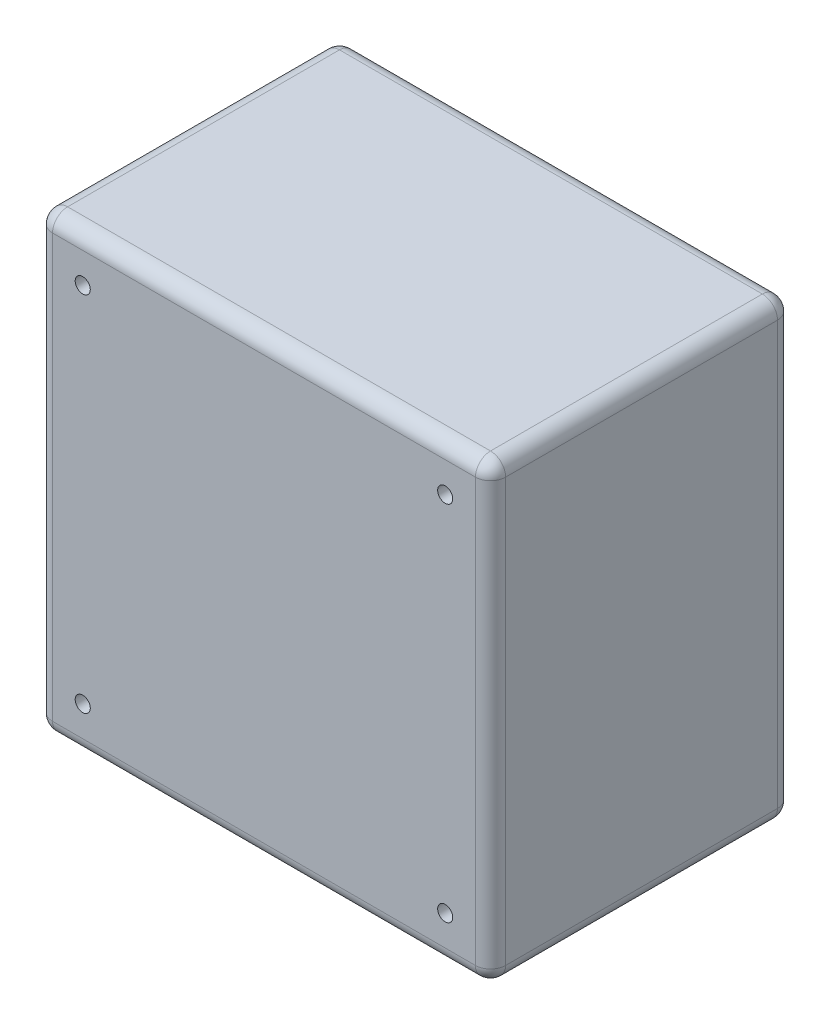
ISO-10303-21;
HEADER;
FILE_DESCRIPTION(('STEP AP214'),'2;1');
FILE_NAME('part.step','',(''),(''),'','','');
FILE_SCHEMA(('AUTOMOTIVE_DESIGN { 1 0 10303 214 1 1 1 1 }'));
ENDSEC;
DATA;
#1=APPLICATION_CONTEXT('core data for automotive mechanical design processes');
#2=APPLICATION_PROTOCOL_DEFINITION('international standard','automotive_design',2000,#1);
#3=PRODUCT_CONTEXT('',#1,'mechanical');
#4=PRODUCT('Part','Part','',(#3));
#5=PRODUCT_RELATED_PRODUCT_CATEGORY('part','',(#4));
#6=PRODUCT_DEFINITION_FORMATION('','',#4);
#7=PRODUCT_DEFINITION_CONTEXT('part definition',#1,'design');
#8=PRODUCT_DEFINITION('design','',#6,#7);
#9=PRODUCT_DEFINITION_SHAPE('','',#8);
#10=(LENGTH_UNIT() NAMED_UNIT(*) SI_UNIT(.MILLI.,.METRE.));
#11=(NAMED_UNIT(*) PLANE_ANGLE_UNIT() SI_UNIT($,.RADIAN.));
#12=(NAMED_UNIT(*) SI_UNIT($,.STERADIAN.) SOLID_ANGLE_UNIT());
#13=UNCERTAINTY_MEASURE_WITH_UNIT(LENGTH_MEASURE(1.E-05),#10,'distance_accuracy_value','');
#14=(GEOMETRIC_REPRESENTATION_CONTEXT(3) GLOBAL_UNCERTAINTY_ASSIGNED_CONTEXT((#13)) GLOBAL_UNIT_ASSIGNED_CONTEXT((#10,
#11,#12)) REPRESENTATION_CONTEXT('',''));
#15=CARTESIAN_POINT('',(0.,0.,0.));
#16=DIRECTION('',(0.,0.,1.));
#17=DIRECTION('',(1.,0.,0.));
#18=AXIS2_PLACEMENT_3D('',#15,#16,#17);
#19=CARTESIAN_POINT('',(15.,-15.,-8.));
#20=DIRECTION('',(0.,0.,1.));
#21=DIRECTION('',(1.,0.,0.));
#22=AXIS2_PLACEMENT_3D('',#19,#20,#21);
#23=CYLINDRICAL_SURFACE('',#22,2.5);
#24=CARTESIAN_POINT('',(15.,-15.,-8.));
#25=DIRECTION('',(0.,0.,1.));
#26=DIRECTION('',(1.,0.,0.));
#27=AXIS2_PLACEMENT_3D('',#24,#25,#26);
#28=CIRCLE('',#27,2.5);
#29=CARTESIAN_POINT('',(17.5,-15.,-8.));
#30=VERTEX_POINT('',#29);
#31=EDGE_CURVE('E44',#30,#30,#28,.T.);
#32=ORIENTED_EDGE('',*,*,#31,.T.);
#33=EDGE_LOOP('',(#32));
#34=FACE_BOUND('',#33,.T.);
#35=CARTESIAN_POINT('',(15.,-15.,0.));
#36=DIRECTION('',(0.,0.,1.));
#37=DIRECTION('',(1.,0.,0.));
#38=AXIS2_PLACEMENT_3D('',#35,#36,#37);
#39=CIRCLE('',#38,2.5);
#40=CARTESIAN_POINT('',(17.5,-15.,0.));
#41=VERTEX_POINT('',#40);
#42=EDGE_CURVE('E11',#41,#41,#39,.T.);
#43=ORIENTED_EDGE('',*,*,#42,.F.);
#44=EDGE_LOOP('',(#43));
#45=FACE_BOUND('',#44,.T.);
#46=ADVANCED_FACE('F40',(#34,#45),#23,.T.);
#47=CARTESIAN_POINT('',(15.,-15.,-8.));
#48=DIRECTION('',(0.,0.,1.));
#49=DIRECTION('',(1.,0.,0.));
#50=AXIS2_PLACEMENT_3D('',#47,#48,#49);
#51=PLANE('',#50);
#52=ORIENTED_EDGE('',*,*,#31,.F.);
#53=EDGE_LOOP('',(#52));
#54=FACE_BOUND('',#53,.T.);
#55=ADVANCED_FACE('F42',(#54),#51,.F.);
#56=CARTESIAN_POINT('',(15.,-15.,0.));
#57=DIRECTION('',(0.,0.,1.));
#58=DIRECTION('',(1.,0.,0.));
#59=AXIS2_PLACEMENT_3D('',#56,#57,#58);
#60=PLANE('',#59);
#61=ORIENTED_EDGE('',*,*,#42,.T.);
#62=EDGE_LOOP('',(#61));
#63=FACE_BOUND('',#62,.T.);
#64=ADVANCED_FACE('F56',(#63),#60,.T.);
#65=CLOSED_SHELL('',(#46,#55,#64));
#66=MANIFOLD_SOLID_BREP('B2',#65);
#67=CARTESIAN_POINT('',(135.,-15.,-8.));
#68=DIRECTION('',(0.,0.,1.));
#69=DIRECTION('',(1.,0.,0.));
#70=AXIS2_PLACEMENT_3D('',#67,#68,#69);
#71=CYLINDRICAL_SURFACE('',#70,2.50000000000002);
#72=CARTESIAN_POINT('',(135.,-15.,-8.));
#73=DIRECTION('',(0.,0.,-1.));
#74=DIRECTION('',(-1.,0.,0.));
#75=AXIS2_PLACEMENT_3D('',#72,#73,#74);
#76=CIRCLE('',#75,2.50000000000002);
#77=CARTESIAN_POINT('',(132.5,-15.,-8.));
#78=VERTEX_POINT('',#77);
#79=EDGE_CURVE('E93',#78,#78,#76,.T.);
#80=ORIENTED_EDGE('',*,*,#79,.F.);
#81=EDGE_LOOP('',(#80));
#82=FACE_BOUND('',#81,.T.);
#83=CARTESIAN_POINT('',(135.,-15.,0.));
#84=DIRECTION('',(0.,0.,-1.));
#85=DIRECTION('',(-1.,0.,0.));
#86=AXIS2_PLACEMENT_3D('',#83,#84,#85);
#87=CIRCLE('',#86,2.50000000000002);
#88=CARTESIAN_POINT('',(132.5,-15.,0.));
#89=VERTEX_POINT('',#88);
#90=EDGE_CURVE('E39',#89,#89,#87,.T.);
#91=ORIENTED_EDGE('',*,*,#90,.T.);
#92=EDGE_LOOP('',(#91));
#93=FACE_BOUND('',#92,.T.);
#94=ADVANCED_FACE('F89',(#82,#93),#71,.T.);
#95=CARTESIAN_POINT('',(135.,-15.,-8.));
#96=DIRECTION('',(0.,0.,-1.));
#97=DIRECTION('',(-1.,0.,0.));
#98=AXIS2_PLACEMENT_3D('',#95,#96,#97);
#99=PLANE('',#98);
#100=ORIENTED_EDGE('',*,*,#79,.T.);
#101=EDGE_LOOP('',(#100));
#102=FACE_BOUND('',#101,.T.);
#103=ADVANCED_FACE('F91',(#102),#99,.T.);
#104=CARTESIAN_POINT('',(135.,-15.,0.));
#105=DIRECTION('',(0.,0.,-1.));
#106=DIRECTION('',(-1.,0.,0.));
#107=AXIS2_PLACEMENT_3D('',#104,#105,#106);
#108=PLANE('',#107);
#109=ORIENTED_EDGE('',*,*,#90,.F.);
#110=EDGE_LOOP('',(#109));
#111=FACE_BOUND('',#110,.T.);
#112=ADVANCED_FACE('F108',(#111),#108,.F.);
#113=CLOSED_SHELL('',(#94,#103,#112));
#114=MANIFOLD_SOLID_BREP('B6',#113);
#115=CARTESIAN_POINT('',(135.,-135.,-8.));
#116=DIRECTION('',(0.,0.,1.));
#117=DIRECTION('',(1.,0.,0.));
#118=AXIS2_PLACEMENT_3D('',#115,#116,#117);
#119=CYLINDRICAL_SURFACE('',#118,2.50000000000002);
#120=CARTESIAN_POINT('',(135.,-135.,-8.));
#121=DIRECTION('',(0.,0.,1.));
#122=DIRECTION('',(1.,0.,0.));
#123=AXIS2_PLACEMENT_3D('',#120,#121,#122);
#124=CIRCLE('',#123,2.50000000000002);
#125=CARTESIAN_POINT('',(137.5,-135.,-8.));
#126=VERTEX_POINT('',#125);
#127=EDGE_CURVE('E142',#126,#126,#124,.T.);
#128=ORIENTED_EDGE('',*,*,#127,.T.);
#129=EDGE_LOOP('',(#128));
#130=FACE_BOUND('',#129,.T.);
#131=CARTESIAN_POINT('',(135.,-135.,0.));
#132=DIRECTION('',(0.,0.,1.));
#133=DIRECTION('',(1.,0.,0.));
#134=AXIS2_PLACEMENT_3D('',#131,#132,#133);
#135=CIRCLE('',#134,2.50000000000002);
#136=CARTESIAN_POINT('',(137.5,-135.,0.));
#137=VERTEX_POINT('',#136);
#138=EDGE_CURVE('E88',#137,#137,#135,.T.);
#139=ORIENTED_EDGE('',*,*,#138,.F.);
#140=EDGE_LOOP('',(#139));
#141=FACE_BOUND('',#140,.T.);
#142=ADVANCED_FACE('F138',(#130,#141),#119,.T.);
#143=CARTESIAN_POINT('',(135.,-135.,-8.));
#144=DIRECTION('',(0.,0.,1.));
#145=DIRECTION('',(1.,0.,0.));
#146=AXIS2_PLACEMENT_3D('',#143,#144,#145);
#147=PLANE('',#146);
#148=ORIENTED_EDGE('',*,*,#127,.F.);
#149=EDGE_LOOP('',(#148));
#150=FACE_BOUND('',#149,.T.);
#151=ADVANCED_FACE('F140',(#150),#147,.F.);
#152=CARTESIAN_POINT('',(135.,-135.,0.));
#153=DIRECTION('',(0.,0.,1.));
#154=DIRECTION('',(1.,0.,0.));
#155=AXIS2_PLACEMENT_3D('',#152,#153,#154);
#156=PLANE('',#155);
#157=ORIENTED_EDGE('',*,*,#138,.T.);
#158=EDGE_LOOP('',(#157));
#159=FACE_BOUND('',#158,.T.);
#160=ADVANCED_FACE('F154',(#159),#156,.T.);
#161=CLOSED_SHELL('',(#142,#151,#160));
#162=MANIFOLD_SOLID_BREP('B34',#161);
#163=CARTESIAN_POINT('',(15.,-135.,-8.));
#164=DIRECTION('',(0.,0.,1.));
#165=DIRECTION('',(1.,0.,0.));
#166=AXIS2_PLACEMENT_3D('',#163,#164,#165);
#167=CYLINDRICAL_SURFACE('',#166,2.5);
#168=CARTESIAN_POINT('',(15.,-135.,-8.));
#169=DIRECTION('',(0.,0.,-1.));
#170=DIRECTION('',(-1.,0.,0.));
#171=AXIS2_PLACEMENT_3D('',#168,#169,#170);
#172=CIRCLE('',#171,2.5);
#173=CARTESIAN_POINT('',(12.5,-135.,-8.));
#174=VERTEX_POINT('',#173);
#175=EDGE_CURVE('E137',#174,#174,#172,.T.);
#176=ORIENTED_EDGE('',*,*,#175,.F.);
#177=EDGE_LOOP('',(#176));
#178=FACE_BOUND('',#177,.T.);
#179=CARTESIAN_POINT('',(15.,-135.,0.));
#180=DIRECTION('',(0.,0.,-1.));
#181=DIRECTION('',(-1.,0.,0.));
#182=AXIS2_PLACEMENT_3D('',#179,#180,#181);
#183=CIRCLE('',#182,2.5);
#184=CARTESIAN_POINT('',(12.5,-135.,0.));
#185=VERTEX_POINT('',#184);
#186=EDGE_CURVE('E191',#185,#185,#183,.T.);
#187=ORIENTED_EDGE('',*,*,#186,.T.);
#188=EDGE_LOOP('',(#187));
#189=FACE_BOUND('',#188,.T.);
#190=ADVANCED_FACE('F188',(#178,#189),#167,.T.);
#191=CARTESIAN_POINT('',(15.,-135.,-8.));
#192=DIRECTION('',(0.,0.,-1.));
#193=DIRECTION('',(-1.,0.,0.));
#194=AXIS2_PLACEMENT_3D('',#191,#192,#193);
#195=PLANE('',#194);
#196=ORIENTED_EDGE('',*,*,#175,.T.);
#197=EDGE_LOOP('',(#196));
#198=FACE_BOUND('',#197,.T.);
#199=ADVANCED_FACE('F203',(#198),#195,.T.);
#200=CARTESIAN_POINT('',(15.,-135.,0.));
#201=DIRECTION('',(0.,0.,-1.));
#202=DIRECTION('',(-1.,0.,0.));
#203=AXIS2_PLACEMENT_3D('',#200,#201,#202);
#204=PLANE('',#203);
#205=ORIENTED_EDGE('',*,*,#186,.F.);
#206=EDGE_LOOP('',(#205));
#207=FACE_BOUND('',#206,.T.);
#208=ADVANCED_FACE('F201',(#207),#204,.F.);
#209=CLOSED_SHELL('',(#190,#199,#208));
#210=MANIFOLD_SOLID_BREP('B83',#209);
#211=CARTESIAN_POINT('',(0.,0.,100.));
#212=DIRECTION('',(0.,0.,1.));
#213=DIRECTION('',(1.,0.,0.));
#214=AXIS2_PLACEMENT_3D('',#211,#212,#213);
#215=PLANE('',#214);
#216=DIRECTION('',(0.,-1.,0.));
#217=VECTOR('',#216,1.);
#218=CARTESIAN_POINT('',(5.00000000000002,-150.,100.));
#219=LINE('',#218,#217);
#220=CARTESIAN_POINT('',(5.,-5.,100.));
#221=VERTEX_POINT('',#220);
#222=CARTESIAN_POINT('',(5.00000000000002,-145.,100.));
#223=VERTEX_POINT('',#222);
#224=EDGE_CURVE('E351',#221,#223,#219,.T.);
#225=ORIENTED_EDGE('',*,*,#224,.T.);
#226=DIRECTION('',(1.,0.,0.));
#227=VECTOR('',#226,1.);
#228=CARTESIAN_POINT('',(150.,-145.,100.));
#229=LINE('',#228,#227);
#230=CARTESIAN_POINT('',(145.,-145.,100.));
#231=VERTEX_POINT('',#230);
#232=EDGE_CURVE('E323',#223,#231,#229,.T.);
#233=ORIENTED_EDGE('',*,*,#232,.T.);
#234=DIRECTION('',(0.,1.,0.));
#235=VECTOR('',#234,1.);
#236=CARTESIAN_POINT('',(145.,0.,100.));
#237=LINE('',#236,#235);
#238=CARTESIAN_POINT('',(145.,-5.,100.));
#239=VERTEX_POINT('',#238);
#240=EDGE_CURVE('E340',#231,#239,#237,.T.);
#241=ORIENTED_EDGE('',*,*,#240,.T.);
#242=DIRECTION('',(-1.,0.,0.));
#243=VECTOR('',#242,1.);
#244=CARTESIAN_POINT('',(0.,-5.,100.));
#245=LINE('',#244,#243);
#246=EDGE_CURVE('E346',#239,#221,#245,.T.);
#247=ORIENTED_EDGE('',*,*,#246,.T.);
#248=EDGE_LOOP('',(#225,#233,#241,#247));
#249=FACE_BOUND('',#248,.T.);
#250=CARTESIAN_POINT('',(135.,-15.,100.));
#251=DIRECTION('',(0.,0.,1.));
#252=DIRECTION('',(-1.,0.,0.));
#253=AXIS2_PLACEMENT_3D('',#250,#251,#252);
#254=CIRCLE('',#253,2.50000000000002);
#255=CARTESIAN_POINT('',(132.5,-15.,100.));
#256=VERTEX_POINT('',#255);
#257=EDGE_CURVE('E464',#256,#256,#254,.T.);
#258=ORIENTED_EDGE('',*,*,#257,.F.);
#259=EDGE_LOOP('',(#258));
#260=FACE_BOUND('',#259,.T.);
#261=CARTESIAN_POINT('',(15.,-15.,100.));
#262=DIRECTION('',(0.,0.,1.));
#263=DIRECTION('',(1.,0.,0.));
#264=AXIS2_PLACEMENT_3D('',#261,#262,#263);
#265=CIRCLE('',#264,2.5);
#266=CARTESIAN_POINT('',(17.5,-15.,100.));
#267=VERTEX_POINT('',#266);
#268=EDGE_CURVE('E347',#267,#267,#265,.T.);
#269=ORIENTED_EDGE('',*,*,#268,.F.);
#270=EDGE_LOOP('',(#269));
#271=FACE_BOUND('',#270,.T.);
#272=CARTESIAN_POINT('',(15.,-135.,100.));
#273=DIRECTION('',(0.,0.,1.));
#274=DIRECTION('',(-1.,0.,0.));
#275=AXIS2_PLACEMENT_3D('',#272,#273,#274);
#276=CIRCLE('',#275,2.5);
#277=CARTESIAN_POINT('',(12.5,-135.,100.));
#278=VERTEX_POINT('',#277);
#279=EDGE_CURVE('E470',#278,#278,#276,.T.);
#280=ORIENTED_EDGE('',*,*,#279,.F.);
#281=EDGE_LOOP('',(#280));
#282=FACE_BOUND('',#281,.T.);
#283=CARTESIAN_POINT('',(135.,-135.,100.));
#284=DIRECTION('',(0.,0.,1.));
#285=DIRECTION('',(1.,0.,0.));
#286=AXIS2_PLACEMENT_3D('',#283,#284,#285);
#287=CIRCLE('',#286,2.50000000000002);
#288=CARTESIAN_POINT('',(137.5,-135.,100.));
#289=VERTEX_POINT('',#288);
#290=EDGE_CURVE('E456',#289,#289,#287,.T.);
#291=ORIENTED_EDGE('',*,*,#290,.F.);
#292=EDGE_LOOP('',(#291));
#293=FACE_BOUND('',#292,.T.);
#294=ADVANCED_FACE('F229',(#249,#260,#271,#282,#293),#215,.T.);
#295=CARTESIAN_POINT('',(0.,0.,0.));
#296=DIRECTION('',(0.,0.,1.));
#297=DIRECTION('',(1.,0.,0.));
#298=AXIS2_PLACEMENT_3D('',#295,#296,#297);
#299=PLANE('',#298);
#300=DIRECTION('',(0.,1.,0.));
#301=VECTOR('',#300,1.);
#302=CARTESIAN_POINT('',(145.,0.,0.));
#303=LINE('',#302,#301);
#304=CARTESIAN_POINT('',(145.,-5.,0.));
#305=VERTEX_POINT('',#304);
#306=CARTESIAN_POINT('',(145.,-145.,0.));
#307=VERTEX_POINT('',#306);
#308=EDGE_CURVE('E364',#305,#307,#303,.F.);
#309=ORIENTED_EDGE('',*,*,#308,.T.);
#310=DIRECTION('',(1.,0.,0.));
#311=VECTOR('',#310,1.);
#312=CARTESIAN_POINT('',(0.,-145.,0.));
#313=LINE('',#312,#311);
#314=CARTESIAN_POINT('',(5.00000000000002,-145.,0.));
#315=VERTEX_POINT('',#314);
#316=EDGE_CURVE('E370',#307,#315,#313,.F.);
#317=ORIENTED_EDGE('',*,*,#316,.T.);
#318=DIRECTION('',(0.,-1.,0.));
#319=VECTOR('',#318,1.);
#320=CARTESIAN_POINT('',(5.,0.,0.));
#321=LINE('',#320,#319);
#322=CARTESIAN_POINT('',(5.,-5.,0.));
#323=VERTEX_POINT('',#322);
#324=EDGE_CURVE('E368',#315,#323,#321,.F.);
#325=ORIENTED_EDGE('',*,*,#324,.T.);
#326=DIRECTION('',(-1.,0.,0.));
#327=VECTOR('',#326,1.);
#328=CARTESIAN_POINT('',(0.,-5.,0.));
#329=LINE('',#328,#327);
#330=EDGE_CURVE('E366',#323,#305,#329,.F.);
#331=ORIENTED_EDGE('',*,*,#330,.T.);
#332=EDGE_LOOP('',(#309,#317,#325,#331));
#333=FACE_BOUND('',#332,.T.);
#334=CARTESIAN_POINT('',(15.,-15.,0.));
#335=DIRECTION('',(0.,0.,1.));
#336=DIRECTION('',(1.,0.,0.));
#337=AXIS2_PLACEMENT_3D('',#334,#335,#336);
#338=CIRCLE('',#337,2.5);
#339=CARTESIAN_POINT('',(17.5,-15.,0.));
#340=VERTEX_POINT('',#339);
#341=EDGE_CURVE('E473',#340,#340,#338,.T.);
#342=ORIENTED_EDGE('',*,*,#341,.T.);
#343=EDGE_LOOP('',(#342));
#344=FACE_BOUND('',#343,.T.);
#345=CARTESIAN_POINT('',(15.,-135.,0.));
#346=DIRECTION('',(0.,0.,1.));
#347=DIRECTION('',(-1.,0.,0.));
#348=AXIS2_PLACEMENT_3D('',#345,#346,#347);
#349=CIRCLE('',#348,2.5);
#350=CARTESIAN_POINT('',(12.5,-135.,0.));
#351=VERTEX_POINT('',#350);
#352=EDGE_CURVE('E467',#351,#351,#349,.T.);
#353=ORIENTED_EDGE('',*,*,#352,.T.);
#354=EDGE_LOOP('',(#353));
#355=FACE_BOUND('',#354,.T.);
#356=CARTESIAN_POINT('',(135.,-15.,0.));
#357=DIRECTION('',(0.,0.,1.));
#358=DIRECTION('',(-1.,0.,0.));
#359=AXIS2_PLACEMENT_3D('',#356,#357,#358);
#360=CIRCLE('',#359,2.50000000000002);
#361=CARTESIAN_POINT('',(132.5,-15.,0.));
#362=VERTEX_POINT('',#361);
#363=EDGE_CURVE('E461',#362,#362,#360,.T.);
#364=ORIENTED_EDGE('',*,*,#363,.T.);
#365=EDGE_LOOP('',(#364));
#366=FACE_BOUND('',#365,.T.);
#367=CARTESIAN_POINT('',(135.,-135.,0.));
#368=DIRECTION('',(0.,0.,1.));
#369=DIRECTION('',(1.,0.,0.));
#370=AXIS2_PLACEMENT_3D('',#367,#368,#369);
#371=CIRCLE('',#370,2.50000000000002);
#372=CARTESIAN_POINT('',(137.5,-135.,0.));
#373=VERTEX_POINT('',#372);
#374=EDGE_CURVE('E450',#373,#373,#371,.T.);
#375=ORIENTED_EDGE('',*,*,#374,.T.);
#376=EDGE_LOOP('',(#375));
#377=FACE_BOUND('',#376,.T.);
#378=ADVANCED_FACE('F533',(#333,#344,#355,#366,#377),#299,.F.);
#379=CARTESIAN_POINT('',(0.,0.,100.));
#380=DIRECTION('',(1.,0.,0.));
#381=DIRECTION('',(0.,1.,0.));
#382=AXIS2_PLACEMENT_3D('',#379,#380,#381);
#383=PLANE('',#382);
#384=DIRECTION('',(0.,0.,-1.));
#385=VECTOR('',#384,1.);
#386=CARTESIAN_POINT('',(0.,-145.,100.));
#387=LINE('',#386,#385);
#388=CARTESIAN_POINT('',(0.,-145.,5.));
#389=VERTEX_POINT('',#388);
#390=CARTESIAN_POINT('',(0.,-145.,95.));
#391=VERTEX_POINT('',#390);
#392=EDGE_CURVE('E377',#389,#391,#387,.F.);
#393=ORIENTED_EDGE('',*,*,#392,.T.);
#394=DIRECTION('',(0.,-1.,0.));
#395=VECTOR('',#394,1.);
#396=CARTESIAN_POINT('',(0.,0.,95.));
#397=LINE('',#396,#395);
#398=CARTESIAN_POINT('',(0.,-5.,95.));
#399=VERTEX_POINT('',#398);
#400=EDGE_CURVE('E379',#391,#399,#397,.F.);
#401=ORIENTED_EDGE('',*,*,#400,.T.);
#402=DIRECTION('',(0.,0.,-1.));
#403=VECTOR('',#402,1.);
#404=CARTESIAN_POINT('',(0.,-5.,100.));
#405=LINE('',#404,#403);
#406=CARTESIAN_POINT('',(0.,-5.,5.));
#407=VERTEX_POINT('',#406);
#408=EDGE_CURVE('E373',#399,#407,#405,.T.);
#409=ORIENTED_EDGE('',*,*,#408,.T.);
#410=DIRECTION('',(0.,-1.,0.));
#411=VECTOR('',#410,1.);
#412=CARTESIAN_POINT('',(0.,0.,5.));
#413=LINE('',#412,#411);
#414=EDGE_CURVE('E375',#407,#389,#413,.T.);
#415=ORIENTED_EDGE('',*,*,#414,.T.);
#416=EDGE_LOOP('',(#393,#401,#409,#415));
#417=FACE_BOUND('',#416,.T.);
#418=ADVANCED_FACE('F538',(#417),#383,.F.);
#419=CARTESIAN_POINT('',(0.,-150.,100.));
#420=DIRECTION('',(0.,1.,0.));
#421=DIRECTION('',(0.,0.,1.));
#422=AXIS2_PLACEMENT_3D('',#419,#420,#421);
#423=PLANE('',#422);
#424=DIRECTION('',(1.,0.,0.));
#425=VECTOR('',#424,1.);
#426=CARTESIAN_POINT('',(0.,-150.,95.));
#427=LINE('',#426,#425);
#428=CARTESIAN_POINT('',(145.,-150.,95.));
#429=VERTEX_POINT('',#428);
#430=CARTESIAN_POINT('',(5.00000000000002,-150.,95.));
#431=VERTEX_POINT('',#430);
#432=EDGE_CURVE('E325',#429,#431,#427,.F.);
#433=ORIENTED_EDGE('',*,*,#432,.T.);
#434=DIRECTION('',(0.,0.,-1.));
#435=VECTOR('',#434,1.);
#436=CARTESIAN_POINT('',(5.00000000000002,-150.,100.));
#437=LINE('',#436,#435);
#438=CARTESIAN_POINT('',(5.00000000000002,-150.,5.));
#439=VERTEX_POINT('',#438);
#440=EDGE_CURVE('E362',#431,#439,#437,.T.);
#441=ORIENTED_EDGE('',*,*,#440,.T.);
#442=DIRECTION('',(1.,0.,0.));
#443=VECTOR('',#442,1.);
#444=CARTESIAN_POINT('',(0.,-150.,5.));
#445=LINE('',#444,#443);
#446=CARTESIAN_POINT('',(145.,-150.,5.));
#447=VERTEX_POINT('',#446);
#448=EDGE_CURVE('E355',#439,#447,#445,.T.);
#449=ORIENTED_EDGE('',*,*,#448,.T.);
#450=DIRECTION('',(0.,0.,-1.));
#451=VECTOR('',#450,1.);
#452=CARTESIAN_POINT('',(145.,-150.,100.));
#453=LINE('',#452,#451);
#454=EDGE_CURVE('E353',#447,#429,#453,.F.);
#455=ORIENTED_EDGE('',*,*,#454,.T.);
#456=EDGE_LOOP('',(#433,#441,#449,#455));
#457=FACE_BOUND('',#456,.T.);
#458=ADVANCED_FACE('F503',(#457),#423,.F.);
#459=CARTESIAN_POINT('',(150.,0.,100.));
#460=DIRECTION('',(-1.,0.,0.));
#461=DIRECTION('',(0.,0.,1.));
#462=AXIS2_PLACEMENT_3D('',#459,#460,#461);
#463=PLANE('',#462);
#464=DIRECTION('',(0.,1.,0.));
#465=VECTOR('',#464,1.);
#466=CARTESIAN_POINT('',(150.,-150.,95.));
#467=LINE('',#466,#465);
#468=CARTESIAN_POINT('',(150.,-5.,95.));
#469=VERTEX_POINT('',#468);
#470=CARTESIAN_POINT('',(150.,-145.,95.));
#471=VERTEX_POINT('',#470);
#472=EDGE_CURVE('E238',#469,#471,#467,.F.);
#473=ORIENTED_EDGE('',*,*,#472,.T.);
#474=DIRECTION('',(0.,0.,-1.));
#475=VECTOR('',#474,1.);
#476=CARTESIAN_POINT('',(150.,-145.,100.));
#477=LINE('',#476,#475);
#478=CARTESIAN_POINT('',(150.,-145.,5.));
#479=VERTEX_POINT('',#478);
#480=EDGE_CURVE('E186',#471,#479,#477,.T.);
#481=ORIENTED_EDGE('',*,*,#480,.T.);
#482=DIRECTION('',(0.,1.,0.));
#483=VECTOR('',#482,1.);
#484=CARTESIAN_POINT('',(150.,0.,5.));
#485=LINE('',#484,#483);
#486=CARTESIAN_POINT('',(150.,-5.,5.));
#487=VERTEX_POINT('',#486);
#488=EDGE_CURVE('E391',#479,#487,#485,.T.);
#489=ORIENTED_EDGE('',*,*,#488,.T.);
#490=DIRECTION('',(0.,0.,-1.));
#491=VECTOR('',#490,1.);
#492=CARTESIAN_POINT('',(150.,-5.,100.));
#493=LINE('',#492,#491);
#494=EDGE_CURVE('E249',#487,#469,#493,.F.);
#495=ORIENTED_EDGE('',*,*,#494,.T.);
#496=EDGE_LOOP('',(#473,#481,#489,#495));
#497=FACE_BOUND('',#496,.T.);
#498=ADVANCED_FACE('F509',(#497),#463,.F.);
#499=CARTESIAN_POINT('',(0.,0.,100.));
#500=DIRECTION('',(0.,-1.,0.));
#501=DIRECTION('',(0.,0.,-1.));
#502=AXIS2_PLACEMENT_3D('',#499,#500,#501);
#503=PLANE('',#502);
#504=DIRECTION('',(0.,0.,-1.));
#505=VECTOR('',#504,1.);
#506=CARTESIAN_POINT('',(5.,0.,100.));
#507=LINE('',#506,#505);
#508=CARTESIAN_POINT('',(5.,0.,5.));
#509=VERTEX_POINT('',#508);
#510=CARTESIAN_POINT('',(5.,0.,95.));
#511=VERTEX_POINT('',#510);
#512=EDGE_CURVE('E386',#509,#511,#507,.F.);
#513=ORIENTED_EDGE('',*,*,#512,.T.);
#514=DIRECTION('',(-1.,0.,0.));
#515=VECTOR('',#514,1.);
#516=CARTESIAN_POINT('',(150.,0.,95.));
#517=LINE('',#516,#515);
#518=CARTESIAN_POINT('',(145.,0.,95.));
#519=VERTEX_POINT('',#518);
#520=EDGE_CURVE('E388',#511,#519,#517,.F.);
#521=ORIENTED_EDGE('',*,*,#520,.T.);
#522=DIRECTION('',(0.,0.,-1.));
#523=VECTOR('',#522,1.);
#524=CARTESIAN_POINT('',(145.,0.,100.));
#525=LINE('',#524,#523);
#526=CARTESIAN_POINT('',(145.,0.,5.));
#527=VERTEX_POINT('',#526);
#528=EDGE_CURVE('E382',#519,#527,#525,.T.);
#529=ORIENTED_EDGE('',*,*,#528,.T.);
#530=DIRECTION('',(-1.,0.,0.));
#531=VECTOR('',#530,1.);
#532=CARTESIAN_POINT('',(0.,0.,5.));
#533=LINE('',#532,#531);
#534=EDGE_CURVE('E384',#527,#509,#533,.T.);
#535=ORIENTED_EDGE('',*,*,#534,.T.);
#536=EDGE_LOOP('',(#513,#521,#529,#535));
#537=FACE_BOUND('',#536,.T.);
#538=ADVANCED_FACE('F545',(#537),#503,.F.);
#539=CARTESIAN_POINT('',(15.,-15.,100.));
#540=DIRECTION('',(0.,0.,-1.));
#541=DIRECTION('',(-1.,0.,0.));
#542=AXIS2_PLACEMENT_3D('',#539,#540,#541);
#543=CYLINDRICAL_SURFACE('',#542,2.5);
#544=ORIENTED_EDGE('',*,*,#268,.T.);
#545=EDGE_LOOP('',(#544));
#546=FACE_BOUND('',#545,.T.);
#547=ORIENTED_EDGE('',*,*,#341,.F.);
#548=EDGE_LOOP('',(#547));
#549=FACE_BOUND('',#548,.T.);
#550=ADVANCED_FACE('F542',(#546,#549),#543,.F.);
#551=CARTESIAN_POINT('',(15.,-135.,100.));
#552=DIRECTION('',(0.,0.,-1.));
#553=DIRECTION('',(-1.,0.,0.));
#554=AXIS2_PLACEMENT_3D('',#551,#552,#553);
#555=CYLINDRICAL_SURFACE('',#554,2.5);
#556=ORIENTED_EDGE('',*,*,#279,.T.);
#557=EDGE_LOOP('',(#556));
#558=FACE_BOUND('',#557,.T.);
#559=ORIENTED_EDGE('',*,*,#352,.F.);
#560=EDGE_LOOP('',(#559));
#561=FACE_BOUND('',#560,.T.);
#562=ADVANCED_FACE('F720',(#558,#561),#555,.F.);
#563=CARTESIAN_POINT('',(135.,-15.,100.));
#564=DIRECTION('',(0.,0.,-1.));
#565=DIRECTION('',(-1.,0.,0.));
#566=AXIS2_PLACEMENT_3D('',#563,#564,#565);
#567=CYLINDRICAL_SURFACE('',#566,2.50000000000002);
#568=ORIENTED_EDGE('',*,*,#257,.T.);
#569=EDGE_LOOP('',(#568));
#570=FACE_BOUND('',#569,.T.);
#571=ORIENTED_EDGE('',*,*,#363,.F.);
#572=EDGE_LOOP('',(#571));
#573=FACE_BOUND('',#572,.T.);
#574=ADVANCED_FACE('F711',(#570,#573),#567,.F.);
#575=CARTESIAN_POINT('',(135.,-135.,100.));
#576=DIRECTION('',(0.,0.,-1.));
#577=DIRECTION('',(-1.,0.,0.));
#578=AXIS2_PLACEMENT_3D('',#575,#576,#577);
#579=CYLINDRICAL_SURFACE('',#578,2.50000000000002);
#580=ORIENTED_EDGE('',*,*,#290,.T.);
#581=EDGE_LOOP('',(#580));
#582=FACE_BOUND('',#581,.T.);
#583=ORIENTED_EDGE('',*,*,#374,.F.);
#584=EDGE_LOOP('',(#583));
#585=FACE_BOUND('',#584,.T.);
#586=ADVANCED_FACE('F702',(#582,#585),#579,.F.);
#587=CARTESIAN_POINT('',(0.,-5.,5.));
#588=DIRECTION('',(-1.,0.,0.));
#589=DIRECTION('',(0.,0.,1.));
#590=AXIS2_PLACEMENT_3D('',#587,#588,#589);
#591=CYLINDRICAL_SURFACE('',#590,5.);
#592=CARTESIAN_POINT('',(5.,-5.,5.));
#593=DIRECTION('',(-1.,0.,0.));
#594=DIRECTION('',(0.,0.,1.));
#595=AXIS2_PLACEMENT_3D('',#592,#593,#594);
#596=CIRCLE('',#595,5.);
#597=EDGE_CURVE('E233',#509,#323,#596,.T.);
#598=ORIENTED_EDGE('',*,*,#597,.F.);
#599=ORIENTED_EDGE('',*,*,#534,.F.);
#600=CARTESIAN_POINT('',(145.,-5.,5.));
#601=DIRECTION('',(1.,0.,0.));
#602=DIRECTION('',(0.,0.,-1.));
#603=AXIS2_PLACEMENT_3D('',#600,#601,#602);
#604=CIRCLE('',#603,5.);
#605=EDGE_CURVE('E443',#305,#527,#604,.T.);
#606=ORIENTED_EDGE('',*,*,#605,.F.);
#607=ORIENTED_EDGE('',*,*,#330,.F.);
#608=EDGE_LOOP('',(#598,#599,#606,#607));
#609=FACE_BOUND('',#608,.T.);
#610=ADVANCED_FACE('F231',(#609),#591,.T.);
#611=CARTESIAN_POINT('',(5.,-5.,5.));
#612=DIRECTION('',(0.,0.,1.));
#613=DIRECTION('',(1.,0.,0.));
#614=AXIS2_PLACEMENT_3D('',#611,#612,#613);
#615=SPHERICAL_SURFACE('',#614,5.);
#616=CARTESIAN_POINT('',(5.,-5.,5.));
#617=DIRECTION('',(0.,0.,-1.));
#618=DIRECTION('',(-1.,0.,0.));
#619=AXIS2_PLACEMENT_3D('',#616,#617,#618);
#620=CIRCLE('',#619,5.);
#621=EDGE_CURVE('E438',#509,#407,#620,.F.);
#622=ORIENTED_EDGE('',*,*,#621,.F.);
#623=ORIENTED_EDGE('',*,*,#597,.T.);
#624=CARTESIAN_POINT('',(5.,-5.,5.));
#625=DIRECTION('',(0.,1.,0.));
#626=DIRECTION('',(-1.,0.,0.));
#627=AXIS2_PLACEMENT_3D('',#624,#625,#626);
#628=CIRCLE('',#627,5.);
#629=EDGE_CURVE('E441',#407,#323,#628,.F.);
#630=ORIENTED_EDGE('',*,*,#629,.F.);
#631=EDGE_LOOP('',(#622,#623,#630));
#632=FACE_BOUND('',#631,.T.);
#633=ADVANCED_FACE('F688',(#632),#615,.T.);
#634=CARTESIAN_POINT('',(145.,-5.,5.));
#635=DIRECTION('',(0.,0.,1.));
#636=DIRECTION('',(1.,0.,0.));
#637=AXIS2_PLACEMENT_3D('',#634,#635,#636);
#638=SPHERICAL_SURFACE('',#637,5.);
#639=CARTESIAN_POINT('',(145.,-5.,5.));
#640=DIRECTION('',(0.,1.,0.));
#641=DIRECTION('',(0.,0.,1.));
#642=AXIS2_PLACEMENT_3D('',#639,#640,#641);
#643=CIRCLE('',#642,5.);
#644=EDGE_CURVE('E432',#305,#487,#643,.F.);
#645=ORIENTED_EDGE('',*,*,#644,.F.);
#646=ORIENTED_EDGE('',*,*,#605,.T.);
#647=CARTESIAN_POINT('',(145.,-5.,5.));
#648=DIRECTION('',(0.,0.,-1.));
#649=DIRECTION('',(-1.,0.,0.));
#650=AXIS2_PLACEMENT_3D('',#647,#648,#649);
#651=CIRCLE('',#650,5.);
#652=EDGE_CURVE('E435',#487,#527,#651,.F.);
#653=ORIENTED_EDGE('',*,*,#652,.F.);
#654=EDGE_LOOP('',(#645,#646,#653));
#655=FACE_BOUND('',#654,.T.);
#656=ADVANCED_FACE('F515',(#655),#638,.T.);
#657=CARTESIAN_POINT('',(5.,0.,5.));
#658=DIRECTION('',(0.,-1.,0.));
#659=DIRECTION('',(1.,0.,0.));
#660=AXIS2_PLACEMENT_3D('',#657,#658,#659);
#661=CYLINDRICAL_SURFACE('',#660,5.);
#662=ORIENTED_EDGE('',*,*,#629,.T.);
#663=ORIENTED_EDGE('',*,*,#324,.F.);
#664=CARTESIAN_POINT('',(5.00000000000002,-145.,5.));
#665=DIRECTION('',(0.,-1.,0.));
#666=DIRECTION('',(0.,0.,-1.));
#667=AXIS2_PLACEMENT_3D('',#664,#665,#666);
#668=CIRCLE('',#667,5.);
#669=EDGE_CURVE('E427',#389,#315,#668,.T.);
#670=ORIENTED_EDGE('',*,*,#669,.F.);
#671=ORIENTED_EDGE('',*,*,#414,.F.);
#672=EDGE_LOOP('',(#662,#663,#670,#671));
#673=FACE_BOUND('',#672,.T.);
#674=ADVANCED_FACE('F671',(#673),#661,.T.);
#675=CARTESIAN_POINT('',(5.,-5.,100.));
#676=DIRECTION('',(0.,0.,-1.));
#677=DIRECTION('',(-1.,0.,0.));
#678=AXIS2_PLACEMENT_3D('',#675,#676,#677);
#679=CYLINDRICAL_SURFACE('',#678,5.);
#680=ORIENTED_EDGE('',*,*,#621,.T.);
#681=ORIENTED_EDGE('',*,*,#408,.F.);
#682=CARTESIAN_POINT('',(5.,-5.,95.));
#683=DIRECTION('',(0.,0.,1.));
#684=DIRECTION('',(1.,0.,0.));
#685=AXIS2_PLACEMENT_3D('',#682,#683,#684);
#686=CIRCLE('',#685,5.);
#687=EDGE_CURVE('E424',#511,#399,#686,.T.);
#688=ORIENTED_EDGE('',*,*,#687,.F.);
#689=ORIENTED_EDGE('',*,*,#512,.F.);
#690=EDGE_LOOP('',(#680,#681,#688,#689));
#691=FACE_BOUND('',#690,.T.);
#692=ADVANCED_FACE('F663',(#691),#679,.T.);
#693=CARTESIAN_POINT('',(0.,-5.,95.));
#694=DIRECTION('',(1.,0.,0.));
#695=DIRECTION('',(0.,0.,-1.));
#696=AXIS2_PLACEMENT_3D('',#693,#694,#695);
#697=CYLINDRICAL_SURFACE('',#696,5.);
#698=CARTESIAN_POINT('',(145.,-5.,95.));
#699=DIRECTION('',(1.,0.,0.));
#700=DIRECTION('',(0.,0.,-1.));
#701=AXIS2_PLACEMENT_3D('',#698,#699,#700);
#702=CIRCLE('',#701,5.);
#703=EDGE_CURVE('E418',#519,#239,#702,.T.);
#704=ORIENTED_EDGE('',*,*,#703,.F.);
#705=ORIENTED_EDGE('',*,*,#520,.F.);
#706=CARTESIAN_POINT('',(5.,-5.,95.));
#707=DIRECTION('',(-1.,0.,0.));
#708=DIRECTION('',(0.,0.,1.));
#709=AXIS2_PLACEMENT_3D('',#706,#707,#708);
#710=CIRCLE('',#709,5.);
#711=EDGE_CURVE('E421',#221,#511,#710,.T.);
#712=ORIENTED_EDGE('',*,*,#711,.F.);
#713=ORIENTED_EDGE('',*,*,#246,.F.);
#714=EDGE_LOOP('',(#704,#705,#712,#713));
#715=FACE_BOUND('',#714,.T.);
#716=ADVANCED_FACE('F484',(#715),#697,.T.);
#717=CARTESIAN_POINT('',(145.,-5.,100.));
#718=DIRECTION('',(0.,0.,-1.));
#719=DIRECTION('',(-1.,0.,0.));
#720=AXIS2_PLACEMENT_3D('',#717,#718,#719);
#721=CYLINDRICAL_SURFACE('',#720,5.);
#722=ORIENTED_EDGE('',*,*,#652,.T.);
#723=ORIENTED_EDGE('',*,*,#528,.F.);
#724=CARTESIAN_POINT('',(145.,-5.,95.));
#725=DIRECTION('',(0.,0.,1.));
#726=DIRECTION('',(1.,0.,0.));
#727=AXIS2_PLACEMENT_3D('',#724,#725,#726);
#728=CIRCLE('',#727,5.);
#729=EDGE_CURVE('E416',#469,#519,#728,.T.);
#730=ORIENTED_EDGE('',*,*,#729,.F.);
#731=ORIENTED_EDGE('',*,*,#494,.F.);
#732=EDGE_LOOP('',(#722,#723,#730,#731));
#733=FACE_BOUND('',#732,.T.);
#734=ADVANCED_FACE('F518',(#733),#721,.T.);
#735=CARTESIAN_POINT('',(145.,0.,5.));
#736=DIRECTION('',(0.,1.,0.));
#737=DIRECTION('',(0.,0.,1.));
#738=AXIS2_PLACEMENT_3D('',#735,#736,#737);
#739=CYLINDRICAL_SURFACE('',#738,5.);
#740=ORIENTED_EDGE('',*,*,#644,.T.);
#741=ORIENTED_EDGE('',*,*,#488,.F.);
#742=CARTESIAN_POINT('',(145.,-145.,5.));
#743=DIRECTION('',(0.,-1.,0.));
#744=DIRECTION('',(0.,0.,-1.));
#745=AXIS2_PLACEMENT_3D('',#742,#743,#744);
#746=CIRCLE('',#745,5.);
#747=EDGE_CURVE('E413',#307,#479,#746,.T.);
#748=ORIENTED_EDGE('',*,*,#747,.F.);
#749=ORIENTED_EDGE('',*,*,#308,.F.);
#750=EDGE_LOOP('',(#740,#741,#748,#749));
#751=FACE_BOUND('',#750,.T.);
#752=ADVANCED_FACE('F514',(#751),#739,.T.);
#753=CARTESIAN_POINT('',(0.,-145.,5.));
#754=DIRECTION('',(1.,0.,0.));
#755=DIRECTION('',(0.,0.,-1.));
#756=AXIS2_PLACEMENT_3D('',#753,#754,#755);
#757=CYLINDRICAL_SURFACE('',#756,5.);
#758=CARTESIAN_POINT('',(5.00000000000002,-145.,5.));
#759=DIRECTION('',(-1.,0.,0.));
#760=DIRECTION('',(0.,0.,1.));
#761=AXIS2_PLACEMENT_3D('',#758,#759,#760);
#762=CIRCLE('',#761,5.);
#763=EDGE_CURVE('E429',#315,#439,#762,.T.);
#764=ORIENTED_EDGE('',*,*,#763,.F.);
#765=ORIENTED_EDGE('',*,*,#316,.F.);
#766=CARTESIAN_POINT('',(145.,-145.,5.));
#767=DIRECTION('',(1.,0.,0.));
#768=DIRECTION('',(0.,0.,-1.));
#769=AXIS2_PLACEMENT_3D('',#766,#767,#768);
#770=CIRCLE('',#769,5.);
#771=EDGE_CURVE('E410',#447,#307,#770,.T.);
#772=ORIENTED_EDGE('',*,*,#771,.F.);
#773=ORIENTED_EDGE('',*,*,#448,.F.);
#774=EDGE_LOOP('',(#764,#765,#772,#773));
#775=FACE_BOUND('',#774,.T.);
#776=ADVANCED_FACE('F632',(#775),#757,.T.);
#777=CARTESIAN_POINT('',(5.00000000000002,-145.,5.));
#778=DIRECTION('',(0.,0.,1.));
#779=DIRECTION('',(1.,0.,0.));
#780=AXIS2_PLACEMENT_3D('',#777,#778,#779);
#781=SPHERICAL_SURFACE('',#780,5.);
#782=ORIENTED_EDGE('',*,*,#669,.T.);
#783=ORIENTED_EDGE('',*,*,#763,.T.);
#784=CARTESIAN_POINT('',(5.00000000000002,-145.,5.));
#785=DIRECTION('',(0.,0.,-1.));
#786=DIRECTION('',(-1.,0.,0.));
#787=AXIS2_PLACEMENT_3D('',#784,#785,#786);
#788=CIRCLE('',#787,5.);
#789=EDGE_CURVE('E407',#389,#439,#788,.F.);
#790=ORIENTED_EDGE('',*,*,#789,.F.);
#791=EDGE_LOOP('',(#782,#783,#790));
#792=FACE_BOUND('',#791,.T.);
#793=ADVANCED_FACE('F530',(#792),#781,.T.);
#794=CARTESIAN_POINT('',(5.,-5.,95.));
#795=DIRECTION('',(0.,0.,1.));
#796=DIRECTION('',(1.,0.,0.));
#797=AXIS2_PLACEMENT_3D('',#794,#795,#796);
#798=SPHERICAL_SURFACE('',#797,5.);
#799=ORIENTED_EDGE('',*,*,#711,.T.);
#800=ORIENTED_EDGE('',*,*,#687,.T.);
#801=CARTESIAN_POINT('',(5.,-5.,95.));
#802=DIRECTION('',(0.,1.,0.));
#803=DIRECTION('',(-1.,0.,0.));
#804=AXIS2_PLACEMENT_3D('',#801,#802,#803);
#805=CIRCLE('',#804,5.);
#806=EDGE_CURVE('E405',#221,#399,#805,.F.);
#807=ORIENTED_EDGE('',*,*,#806,.F.);
#808=EDGE_LOOP('',(#799,#800,#807));
#809=FACE_BOUND('',#808,.T.);
#810=ADVANCED_FACE('F487',(#809),#798,.T.);
#811=CARTESIAN_POINT('',(145.,-5.,95.));
#812=DIRECTION('',(0.,0.,1.));
#813=DIRECTION('',(1.,0.,0.));
#814=AXIS2_PLACEMENT_3D('',#811,#812,#813);
#815=SPHERICAL_SURFACE('',#814,5.);
#816=ORIENTED_EDGE('',*,*,#729,.T.);
#817=ORIENTED_EDGE('',*,*,#703,.T.);
#818=CARTESIAN_POINT('',(145.,-5.,95.));
#819=DIRECTION('',(0.,1.,0.));
#820=DIRECTION('',(0.,0.,1.));
#821=AXIS2_PLACEMENT_3D('',#818,#819,#820);
#822=CIRCLE('',#821,5.);
#823=EDGE_CURVE('E343',#469,#239,#822,.F.);
#824=ORIENTED_EDGE('',*,*,#823,.F.);
#825=EDGE_LOOP('',(#816,#817,#824));
#826=FACE_BOUND('',#825,.T.);
#827=ADVANCED_FACE('F520',(#826),#815,.T.);
#828=CARTESIAN_POINT('',(145.,-145.,5.));
#829=DIRECTION('',(0.,0.,1.));
#830=DIRECTION('',(1.,0.,0.));
#831=AXIS2_PLACEMENT_3D('',#828,#829,#830);
#832=SPHERICAL_SURFACE('',#831,5.);
#833=ORIENTED_EDGE('',*,*,#771,.T.);
#834=ORIENTED_EDGE('',*,*,#747,.T.);
#835=CARTESIAN_POINT('',(145.,-145.,5.));
#836=DIRECTION('',(0.,0.,-1.));
#837=DIRECTION('',(-1.,0.,0.));
#838=AXIS2_PLACEMENT_3D('',#835,#836,#837);
#839=CIRCLE('',#838,5.);
#840=EDGE_CURVE('E402',#447,#479,#839,.F.);
#841=ORIENTED_EDGE('',*,*,#840,.F.);
#842=EDGE_LOOP('',(#833,#834,#841));
#843=FACE_BOUND('',#842,.T.);
#844=ADVANCED_FACE('F522',(#843),#832,.T.);
#845=CARTESIAN_POINT('',(5.00000000000002,-145.,100.));
#846=DIRECTION('',(0.,0.,-1.));
#847=DIRECTION('',(-1.,0.,0.));
#848=AXIS2_PLACEMENT_3D('',#845,#846,#847);
#849=CYLINDRICAL_SURFACE('',#848,5.);
#850=ORIENTED_EDGE('',*,*,#789,.T.);
#851=ORIENTED_EDGE('',*,*,#440,.F.);
#852=CARTESIAN_POINT('',(5.00000000000002,-145.,95.));
#853=DIRECTION('',(0.,0.,1.));
#854=DIRECTION('',(1.,0.,0.));
#855=AXIS2_PLACEMENT_3D('',#852,#853,#854);
#856=CIRCLE('',#855,5.);
#857=EDGE_CURVE('E399',#391,#431,#856,.T.);
#858=ORIENTED_EDGE('',*,*,#857,.F.);
#859=ORIENTED_EDGE('',*,*,#392,.F.);
#860=EDGE_LOOP('',(#850,#851,#858,#859));
#861=FACE_BOUND('',#860,.T.);
#862=ADVANCED_FACE('F499',(#861),#849,.T.);
#863=CARTESIAN_POINT('',(5.,0.,95.));
#864=DIRECTION('',(0.,1.,0.));
#865=DIRECTION('',(-1.,0.,0.));
#866=AXIS2_PLACEMENT_3D('',#863,#864,#865);
#867=CYLINDRICAL_SURFACE('',#866,5.);
#868=ORIENTED_EDGE('',*,*,#806,.T.);
#869=ORIENTED_EDGE('',*,*,#400,.F.);
#870=CARTESIAN_POINT('',(5.00000000000002,-145.,95.));
#871=DIRECTION('',(0.,-1.,0.));
#872=DIRECTION('',(0.,0.,-1.));
#873=AXIS2_PLACEMENT_3D('',#870,#871,#872);
#874=CIRCLE('',#873,5.);
#875=EDGE_CURVE('E337',#223,#391,#874,.T.);
#876=ORIENTED_EDGE('',*,*,#875,.F.);
#877=ORIENTED_EDGE('',*,*,#224,.F.);
#878=EDGE_LOOP('',(#868,#869,#876,#877));
#879=FACE_BOUND('',#878,.T.);
#880=ADVANCED_FACE('F491',(#879),#867,.T.);
#881=CARTESIAN_POINT('',(145.,0.,95.));
#882=DIRECTION('',(0.,-1.,0.));
#883=DIRECTION('',(0.,0.,-1.));
#884=AXIS2_PLACEMENT_3D('',#881,#882,#883);
#885=CYLINDRICAL_SURFACE('',#884,5.);
#886=ORIENTED_EDGE('',*,*,#823,.T.);
#887=ORIENTED_EDGE('',*,*,#240,.F.);
#888=CARTESIAN_POINT('',(145.,-145.,95.));
#889=DIRECTION('',(0.,-1.,0.));
#890=DIRECTION('',(0.,0.,-1.));
#891=AXIS2_PLACEMENT_3D('',#888,#889,#890);
#892=CIRCLE('',#891,5.);
#893=EDGE_CURVE('E331',#471,#231,#892,.T.);
#894=ORIENTED_EDGE('',*,*,#893,.F.);
#895=ORIENTED_EDGE('',*,*,#472,.F.);
#896=EDGE_LOOP('',(#886,#887,#894,#895));
#897=FACE_BOUND('',#896,.T.);
#898=ADVANCED_FACE('F341',(#897),#885,.T.);
#899=CARTESIAN_POINT('',(145.,-145.,100.));
#900=DIRECTION('',(0.,0.,-1.));
#901=DIRECTION('',(-1.,0.,0.));
#902=AXIS2_PLACEMENT_3D('',#899,#900,#901);
#903=CYLINDRICAL_SURFACE('',#902,5.);
#904=ORIENTED_EDGE('',*,*,#840,.T.);
#905=ORIENTED_EDGE('',*,*,#480,.F.);
#906=CARTESIAN_POINT('',(145.,-145.,95.));
#907=DIRECTION('',(0.,0.,1.));
#908=DIRECTION('',(1.,0.,0.));
#909=AXIS2_PLACEMENT_3D('',#906,#907,#908);
#910=CIRCLE('',#909,5.);
#911=EDGE_CURVE('E335',#429,#471,#910,.T.);
#912=ORIENTED_EDGE('',*,*,#911,.F.);
#913=ORIENTED_EDGE('',*,*,#454,.F.);
#914=EDGE_LOOP('',(#904,#905,#912,#913));
#915=FACE_BOUND('',#914,.T.);
#916=ADVANCED_FACE('F507',(#915),#903,.T.);
#917=CARTESIAN_POINT('',(5.00000000000002,-145.,95.));
#918=DIRECTION('',(0.,0.,1.));
#919=DIRECTION('',(1.,0.,0.));
#920=AXIS2_PLACEMENT_3D('',#917,#918,#919);
#921=SPHERICAL_SURFACE('',#920,5.);
#922=ORIENTED_EDGE('',*,*,#875,.T.);
#923=ORIENTED_EDGE('',*,*,#857,.T.);
#924=CARTESIAN_POINT('',(5.00000000000002,-145.,95.));
#925=DIRECTION('',(-1.,0.,0.));
#926=DIRECTION('',(0.,0.,1.));
#927=AXIS2_PLACEMENT_3D('',#924,#925,#926);
#928=CIRCLE('',#927,5.);
#929=EDGE_CURVE('E328',#223,#431,#928,.F.);
#930=ORIENTED_EDGE('',*,*,#929,.F.);
#931=EDGE_LOOP('',(#922,#923,#930));
#932=FACE_BOUND('',#931,.T.);
#933=ADVANCED_FACE('F495',(#932),#921,.T.);
#934=CARTESIAN_POINT('',(145.,-145.,95.));
#935=DIRECTION('',(0.,0.,1.));
#936=DIRECTION('',(1.,0.,0.));
#937=AXIS2_PLACEMENT_3D('',#934,#935,#936);
#938=SPHERICAL_SURFACE('',#937,5.);
#939=ORIENTED_EDGE('',*,*,#911,.T.);
#940=ORIENTED_EDGE('',*,*,#893,.T.);
#941=CARTESIAN_POINT('',(145.,-145.,95.));
#942=DIRECTION('',(1.,0.,0.));
#943=DIRECTION('',(0.,0.,-1.));
#944=AXIS2_PLACEMENT_3D('',#941,#942,#943);
#945=CIRCLE('',#944,5.);
#946=EDGE_CURVE('E319',#429,#231,#945,.F.);
#947=ORIENTED_EDGE('',*,*,#946,.F.);
#948=EDGE_LOOP('',(#939,#940,#947));
#949=FACE_BOUND('',#948,.T.);
#950=ADVANCED_FACE('F333',(#949),#938,.T.);
#951=CARTESIAN_POINT('',(0.,-145.,95.));
#952=DIRECTION('',(-1.,0.,0.));
#953=DIRECTION('',(0.,0.,1.));
#954=AXIS2_PLACEMENT_3D('',#951,#952,#953);
#955=CYLINDRICAL_SURFACE('',#954,5.);
#956=ORIENTED_EDGE('',*,*,#929,.T.);
#957=ORIENTED_EDGE('',*,*,#432,.F.);
#958=ORIENTED_EDGE('',*,*,#946,.T.);
#959=ORIENTED_EDGE('',*,*,#232,.F.);
#960=EDGE_LOOP('',(#956,#957,#958,#959));
#961=FACE_BOUND('',#960,.T.);
#962=ADVANCED_FACE('F321',(#961),#955,.T.);
#963=CLOSED_SHELL('',(#294,#378,#418,#458,#498,#538,#550,#562,#574,#586,#610,#633,#656,#674,
#692,#716,#734,#752,#776,#793,#810,#827,#844,#862,#880,#898,#916,#933,#950,#962));
#964=MANIFOLD_SOLID_BREP('B132',#963);
#965=ADVANCED_BREP_SHAPE_REPRESENTATION('',(#18,#66,#114,#162,#210,#964),#14);
#966=SHAPE_DEFINITION_REPRESENTATION(#9,#965);
ENDSEC;
END-ISO-10303-21;
